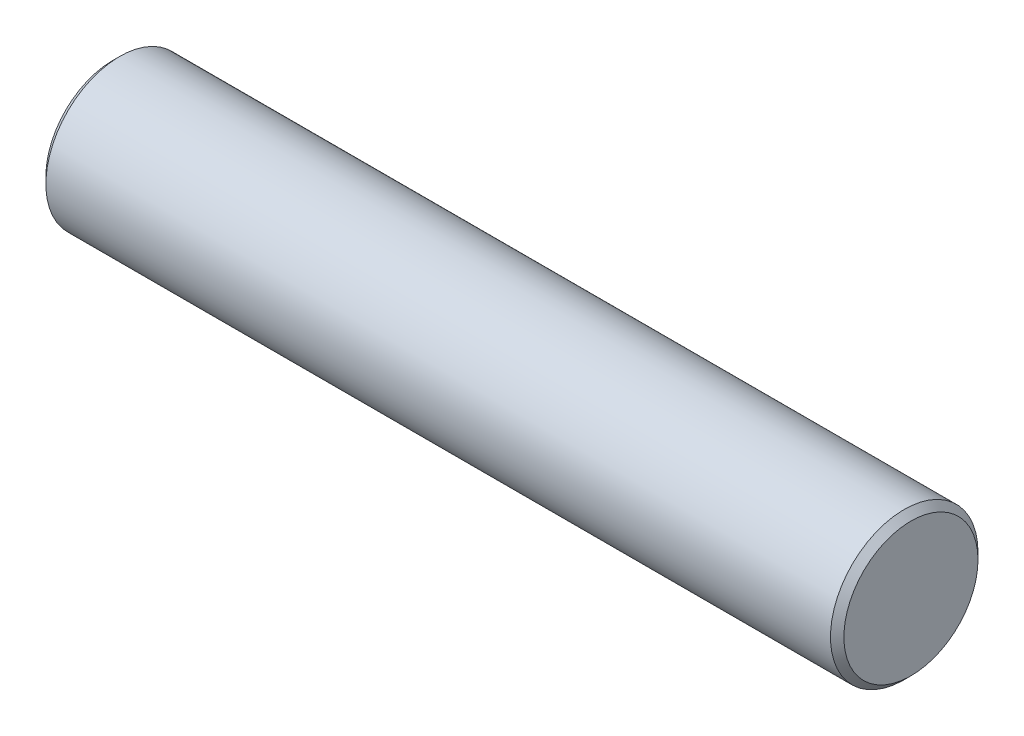
ISO-10303-21;
HEADER;
FILE_DESCRIPTION(('STEP AP214'),'2;1');
FILE_NAME('part.step','',(''),(''),'','','');
FILE_SCHEMA(('AUTOMOTIVE_DESIGN { 1 0 10303 214 1 1 1 1 }'));
ENDSEC;
DATA;
#1=APPLICATION_CONTEXT('core data for automotive mechanical design processes');
#2=APPLICATION_PROTOCOL_DEFINITION('international standard','automotive_design',2000,#1);
#3=PRODUCT_CONTEXT('',#1,'mechanical');
#4=PRODUCT('Part','Part','',(#3));
#5=PRODUCT_RELATED_PRODUCT_CATEGORY('part','',(#4));
#6=PRODUCT_DEFINITION_FORMATION('','',#4);
#7=PRODUCT_DEFINITION_CONTEXT('part definition',#1,'design');
#8=PRODUCT_DEFINITION('design','',#6,#7);
#9=PRODUCT_DEFINITION_SHAPE('','',#8);
#10=(LENGTH_UNIT() NAMED_UNIT(*) SI_UNIT(.MILLI.,.METRE.));
#11=(NAMED_UNIT(*) PLANE_ANGLE_UNIT() SI_UNIT($,.RADIAN.));
#12=(NAMED_UNIT(*) SI_UNIT($,.STERADIAN.) SOLID_ANGLE_UNIT());
#13=UNCERTAINTY_MEASURE_WITH_UNIT(LENGTH_MEASURE(1.E-05),#10,'distance_accuracy_value','');
#14=(GEOMETRIC_REPRESENTATION_CONTEXT(3) GLOBAL_UNCERTAINTY_ASSIGNED_CONTEXT((#13)) GLOBAL_UNIT_ASSIGNED_CONTEXT((#10,
#11,#12)) REPRESENTATION_CONTEXT('',''));
#15=CARTESIAN_POINT('',(0.,0.,0.));
#16=DIRECTION('',(0.,0.,1.));
#17=DIRECTION('',(1.,0.,0.));
#18=AXIS2_PLACEMENT_3D('',#15,#16,#17);
#19=CARTESIAN_POINT('',(59.5,0.,0.));
#20=DIRECTION('',(-1.,0.,0.));
#21=DIRECTION('',(0.,0.,1.));
#22=AXIS2_PLACEMENT_3D('',#19,#20,#21);
#23=CYLINDRICAL_SURFACE('',#22,11.);
#24=CARTESIAN_POINT('',(-58.5,0.,0.));
#25=DIRECTION('',(1.,0.,0.));
#26=DIRECTION('',(0.,0.,-1.));
#27=AXIS2_PLACEMENT_3D('',#24,#25,#26);
#28=CIRCLE('',#27,11.);
#29=CARTESIAN_POINT('',(-58.5,0.,-11.));
#30=VERTEX_POINT('',#29);
#31=EDGE_CURVE('E46',#30,#30,#28,.T.);
#32=ORIENTED_EDGE('',*,*,#31,.T.);
#33=EDGE_LOOP('',(#32));
#34=FACE_BOUND('',#33,.T.);
#35=CARTESIAN_POINT('',(58.5,0.,0.));
#36=DIRECTION('',(1.,0.,0.));
#37=DIRECTION('',(0.,0.,-1.));
#38=AXIS2_PLACEMENT_3D('',#35,#36,#37);
#39=CIRCLE('',#38,11.);
#40=CARTESIAN_POINT('',(58.5,0.,-11.));
#41=VERTEX_POINT('',#40);
#42=EDGE_CURVE('E50',#41,#41,#39,.F.);
#43=ORIENTED_EDGE('',*,*,#42,.T.);
#44=EDGE_LOOP('',(#43));
#45=FACE_BOUND('',#44,.T.);
#46=ADVANCED_FACE('F34',(#34,#45),#23,.T.);
#47=CARTESIAN_POINT('',(59.5,0.,0.));
#48=DIRECTION('',(1.,0.,0.));
#49=DIRECTION('',(0.,0.,-1.));
#50=AXIS2_PLACEMENT_3D('',#47,#48,#49);
#51=PLANE('',#50);
#52=CARTESIAN_POINT('',(59.5,0.,0.));
#53=DIRECTION('',(1.,0.,0.));
#54=DIRECTION('',(0.,0.,-1.));
#55=AXIS2_PLACEMENT_3D('',#52,#53,#54);
#56=CIRCLE('',#55,10.);
#57=CARTESIAN_POINT('',(59.5,0.,-10.));
#58=VERTEX_POINT('',#57);
#59=EDGE_CURVE('E10',#58,#58,#56,.T.);
#60=ORIENTED_EDGE('',*,*,#59,.T.);
#61=EDGE_LOOP('',(#60));
#62=FACE_BOUND('',#61,.T.);
#63=ADVANCED_FACE('F66',(#62),#51,.T.);
#64=CARTESIAN_POINT('',(-59.5,0.,0.));
#65=DIRECTION('',(1.,0.,0.));
#66=DIRECTION('',(0.,0.,-1.));
#67=AXIS2_PLACEMENT_3D('',#64,#65,#66);
#68=PLANE('',#67);
#69=CARTESIAN_POINT('',(-59.5,0.,0.));
#70=DIRECTION('',(1.,0.,0.));
#71=DIRECTION('',(0.,0.,-1.));
#72=AXIS2_PLACEMENT_3D('',#69,#70,#71);
#73=CIRCLE('',#72,9.99999999999999);
#74=CARTESIAN_POINT('',(-59.5,0.,-9.99999999999999));
#75=VERTEX_POINT('',#74);
#76=EDGE_CURVE('E42',#75,#75,#73,.F.);
#77=ORIENTED_EDGE('',*,*,#76,.T.);
#78=EDGE_LOOP('',(#77));
#79=FACE_BOUND('',#78,.T.);
#80=ADVANCED_FACE('F63',(#79),#68,.F.);
#81=CARTESIAN_POINT('',(-58.5,0.,0.));
#82=DIRECTION('',(1.,0.,0.));
#83=DIRECTION('',(0.,0.,-1.));
#84=AXIS2_PLACEMENT_3D('',#81,#82,#83);
#85=CONICAL_SURFACE('',#84,11.,0.785398163397457);
#86=ORIENTED_EDGE('',*,*,#76,.F.);
#87=EDGE_LOOP('',(#86));
#88=FACE_BOUND('',#87,.T.);
#89=ORIENTED_EDGE('',*,*,#31,.F.);
#90=EDGE_LOOP('',(#89));
#91=FACE_BOUND('',#90,.T.);
#92=ADVANCED_FACE('F59',(#88,#91),#85,.T.);
#93=CARTESIAN_POINT('',(59.5,0.,0.));
#94=DIRECTION('',(-1.,0.,0.));
#95=DIRECTION('',(0.,0.,1.));
#96=AXIS2_PLACEMENT_3D('',#93,#94,#95);
#97=CONICAL_SURFACE('',#96,10.,0.78539816339745);
#98=ORIENTED_EDGE('',*,*,#42,.F.);
#99=EDGE_LOOP('',(#98));
#100=FACE_BOUND('',#99,.T.);
#101=ORIENTED_EDGE('',*,*,#59,.F.);
#102=EDGE_LOOP('',(#101));
#103=FACE_BOUND('',#102,.T.);
#104=ADVANCED_FACE('F37',(#100,#103),#97,.T.);
#105=CLOSED_SHELL('',(#46,#63,#80,#92,#104));
#106=MANIFOLD_SOLID_BREP('B2',#105);
#107=ADVANCED_BREP_SHAPE_REPRESENTATION('',(#18,#106),#14);
#108=SHAPE_DEFINITION_REPRESENTATION(#9,#107);
ENDSEC;
END-ISO-10303-21;
